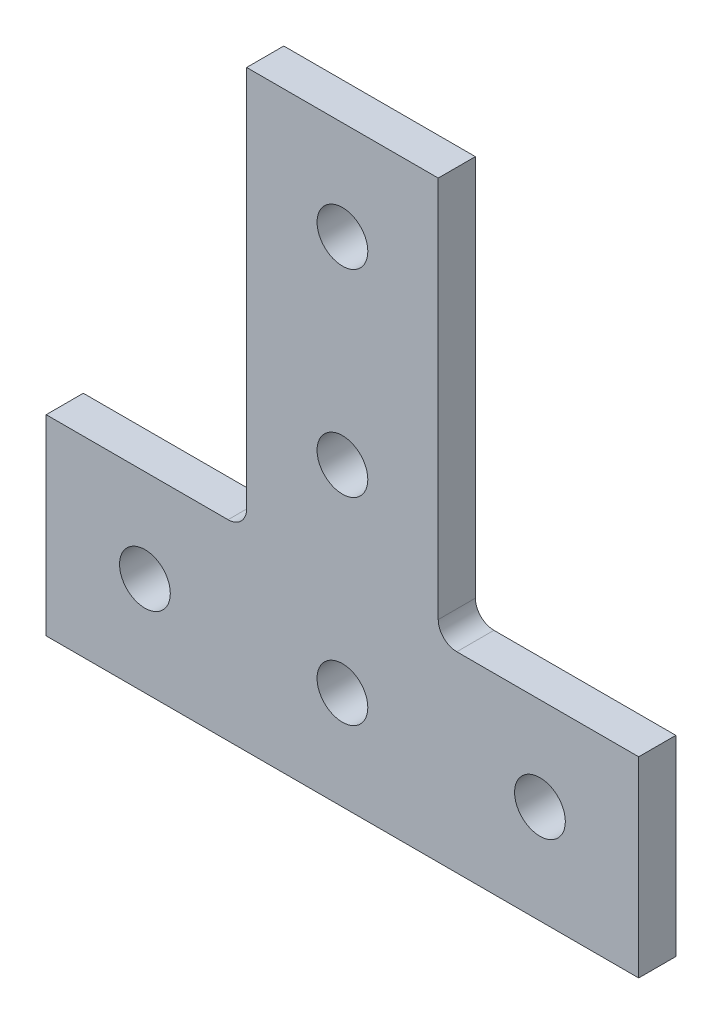
ISO-10303-21;
HEADER;
FILE_DESCRIPTION(('STEP AP214'),'2;1');
FILE_NAME('part.step','',(''),(''),'','','');
FILE_SCHEMA(('AUTOMOTIVE_DESIGN { 1 0 10303 214 1 1 1 1 }'));
ENDSEC;
DATA;
#1=APPLICATION_CONTEXT('core data for automotive mechanical design processes');
#2=APPLICATION_PROTOCOL_DEFINITION('international standard','automotive_design',2000,#1);
#3=PRODUCT_CONTEXT('',#1,'mechanical');
#4=PRODUCT('Part','Part','',(#3));
#5=PRODUCT_RELATED_PRODUCT_CATEGORY('part','',(#4));
#6=PRODUCT_DEFINITION_FORMATION('','',#4);
#7=PRODUCT_DEFINITION_CONTEXT('part definition',#1,'design');
#8=PRODUCT_DEFINITION('design','',#6,#7);
#9=PRODUCT_DEFINITION_SHAPE('','',#8);
#10=(LENGTH_UNIT() NAMED_UNIT(*) SI_UNIT(.MILLI.,.METRE.));
#11=(NAMED_UNIT(*) PLANE_ANGLE_UNIT() SI_UNIT($,.RADIAN.));
#12=(NAMED_UNIT(*) SI_UNIT($,.STERADIAN.) SOLID_ANGLE_UNIT());
#13=UNCERTAINTY_MEASURE_WITH_UNIT(LENGTH_MEASURE(1.E-05),#10,'distance_accuracy_value','');
#14=(GEOMETRIC_REPRESENTATION_CONTEXT(3) GLOBAL_UNCERTAINTY_ASSIGNED_CONTEXT((#13)) GLOBAL_UNIT_ASSIGNED_CONTEXT((#10,
#11,#12)) REPRESENTATION_CONTEXT('',''));
#15=CARTESIAN_POINT('',(0.,0.,0.));
#16=DIRECTION('',(0.,0.,1.));
#17=DIRECTION('',(1.,0.,0.));
#18=AXIS2_PLACEMENT_3D('',#15,#16,#17);
#19=CARTESIAN_POINT('',(14.7066,27.0256,4.7752));
#20=DIRECTION('',(0.,0.,-1.));
#21=DIRECTION('',(-1.,0.,0.));
#22=AXIS2_PLACEMENT_3D('',#19,#20,#21);
#23=PLANE('',#22);
#24=CARTESIAN_POINT('',(0.,12.7,4.7752));
#25=DIRECTION('',(0.,0.,1.));
#26=DIRECTION('',(1.,0.,0.));
#27=AXIS2_PLACEMENT_3D('',#24,#25,#26);
#28=CIRCLE('',#27,3.2639);
#29=CARTESIAN_POINT('',(3.2639,12.7,4.7752));
#30=VERTEX_POINT('',#29);
#31=EDGE_CURVE('E224',#30,#30,#28,.T.);
#32=ORIENTED_EDGE('',*,*,#31,.F.);
#33=EDGE_LOOP('',(#32));
#34=FACE_BOUND('',#33,.T.);
#35=CARTESIAN_POINT('',(0.,38.1,4.7752));
#36=DIRECTION('',(0.,0.,1.));
#37=DIRECTION('',(1.,0.,0.));
#38=AXIS2_PLACEMENT_3D('',#35,#36,#37);
#39=CIRCLE('',#38,3.2639);
#40=CARTESIAN_POINT('',(3.2639,38.1,4.7752));
#41=VERTEX_POINT('',#40);
#42=EDGE_CURVE('E212',#41,#41,#39,.T.);
#43=ORIENTED_EDGE('',*,*,#42,.F.);
#44=EDGE_LOOP('',(#43));
#45=FACE_BOUND('',#44,.T.);
#46=DIRECTION('',(0.,-1.,0.));
#47=VECTOR('',#46,1.);
#48=CARTESIAN_POINT('',(-38.1,24.638,4.7752));
#49=LINE('',#48,#47);
#50=CARTESIAN_POINT('',(-38.1,24.638,4.7752));
#51=VERTEX_POINT('',#50);
#52=CARTESIAN_POINT('',(-38.1,0.,4.7752));
#53=VERTEX_POINT('',#52);
#54=EDGE_CURVE('E161',#51,#53,#49,.T.);
#55=ORIENTED_EDGE('',*,*,#54,.T.);
#56=DIRECTION('',(1.,0.,0.));
#57=VECTOR('',#56,1.);
#58=CARTESIAN_POINT('',(-38.1,0.,4.7752));
#59=LINE('',#58,#57);
#60=CARTESIAN_POINT('',(38.1,0.,4.7752));
#61=VERTEX_POINT('',#60);
#62=EDGE_CURVE('E99',#53,#61,#59,.T.);
#63=ORIENTED_EDGE('',*,*,#62,.T.);
#64=DIRECTION('',(0.,1.,0.));
#65=VECTOR('',#64,1.);
#66=CARTESIAN_POINT('',(38.1,0.,4.7752));
#67=LINE('',#66,#65);
#68=CARTESIAN_POINT('',(38.1,24.638,4.7752));
#69=VERTEX_POINT('',#68);
#70=EDGE_CURVE('E182',#61,#69,#67,.T.);
#71=ORIENTED_EDGE('',*,*,#70,.T.);
#72=DIRECTION('',(-1.,0.,0.));
#73=VECTOR('',#72,1.);
#74=CARTESIAN_POINT('',(38.1,24.638,4.7752));
#75=LINE('',#74,#73);
#76=CARTESIAN_POINT('',(14.7066,24.638,4.7752));
#77=VERTEX_POINT('',#76);
#78=EDGE_CURVE('E201',#69,#77,#75,.T.);
#79=ORIENTED_EDGE('',*,*,#78,.T.);
#80=CARTESIAN_POINT('',(14.7066,27.0256,4.7752));
#81=DIRECTION('',(0.,0.,-1.));
#82=DIRECTION('',(-1.,0.,0.));
#83=AXIS2_PLACEMENT_3D('',#80,#81,#82);
#84=CIRCLE('',#83,2.38760000000001);
#85=CARTESIAN_POINT('',(12.319,27.0256,4.7752));
#86=VERTEX_POINT('',#85);
#87=EDGE_CURVE('E198',#77,#86,#84,.T.);
#88=ORIENTED_EDGE('',*,*,#87,.T.);
#89=DIRECTION('',(0.,1.,0.));
#90=VECTOR('',#89,1.);
#91=CARTESIAN_POINT('',(12.319,27.0256,4.7752));
#92=LINE('',#91,#90);
#93=CARTESIAN_POINT('',(12.319,76.2,4.7752));
#94=VERTEX_POINT('',#93);
#95=EDGE_CURVE('E200',#86,#94,#92,.T.);
#96=ORIENTED_EDGE('',*,*,#95,.T.);
#97=DIRECTION('',(-1.,0.,0.));
#98=VECTOR('',#97,1.);
#99=CARTESIAN_POINT('',(12.319,76.2,4.7752));
#100=LINE('',#99,#98);
#101=CARTESIAN_POINT('',(-12.319,76.2,4.7752));
#102=VERTEX_POINT('',#101);
#103=EDGE_CURVE('E124',#94,#102,#100,.T.);
#104=ORIENTED_EDGE('',*,*,#103,.T.);
#105=DIRECTION('',(0.,-1.,0.));
#106=VECTOR('',#105,1.);
#107=CARTESIAN_POINT('',(-12.319,76.2,4.7752));
#108=LINE('',#107,#106);
#109=CARTESIAN_POINT('',(-12.319,27.0256,4.7752));
#110=VERTEX_POINT('',#109);
#111=EDGE_CURVE('E118',#102,#110,#108,.T.);
#112=ORIENTED_EDGE('',*,*,#111,.T.);
#113=CARTESIAN_POINT('',(-14.7066,27.0256,4.7752));
#114=DIRECTION('',(0.,0.,-1.));
#115=DIRECTION('',(-1.,0.,0.));
#116=AXIS2_PLACEMENT_3D('',#113,#114,#115);
#117=CIRCLE('',#116,2.3876);
#118=CARTESIAN_POINT('',(-14.7066,24.638,4.7752));
#119=VERTEX_POINT('',#118);
#120=EDGE_CURVE('E122',#110,#119,#117,.T.);
#121=ORIENTED_EDGE('',*,*,#120,.T.);
#122=DIRECTION('',(-1.,0.,0.));
#123=VECTOR('',#122,1.);
#124=CARTESIAN_POINT('',(-14.7066,24.638,4.7752));
#125=LINE('',#124,#123);
#126=EDGE_CURVE('E50',#119,#51,#125,.T.);
#127=ORIENTED_EDGE('',*,*,#126,.T.);
#128=EDGE_LOOP('',(#55,#63,#71,#79,#88,#96,#104,#112,#121,#127));
#129=FACE_BOUND('',#128,.T.);
#130=CARTESIAN_POINT('',(25.4,12.7,4.7752));
#131=DIRECTION('',(0.,0.,1.));
#132=DIRECTION('',(1.,0.,0.));
#133=AXIS2_PLACEMENT_3D('',#130,#131,#132);
#134=CIRCLE('',#133,3.2639);
#135=CARTESIAN_POINT('',(28.6639,12.7,4.7752));
#136=VERTEX_POINT('',#135);
#137=EDGE_CURVE('E146',#136,#136,#134,.T.);
#138=ORIENTED_EDGE('',*,*,#137,.F.);
#139=EDGE_LOOP('',(#138));
#140=FACE_BOUND('',#139,.T.);
#141=CARTESIAN_POINT('',(0.,63.5,4.7752));
#142=DIRECTION('',(0.,0.,1.));
#143=DIRECTION('',(1.,0.,0.));
#144=AXIS2_PLACEMENT_3D('',#141,#142,#143);
#145=CIRCLE('',#144,3.2639);
#146=CARTESIAN_POINT('',(3.2639,63.5,4.7752));
#147=VERTEX_POINT('',#146);
#148=EDGE_CURVE('E218',#147,#147,#145,.T.);
#149=ORIENTED_EDGE('',*,*,#148,.F.);
#150=EDGE_LOOP('',(#149));
#151=FACE_BOUND('',#150,.T.);
#152=CARTESIAN_POINT('',(-25.4,12.7,4.7752));
#153=DIRECTION('',(0.,0.,1.));
#154=DIRECTION('',(1.,0.,0.));
#155=AXIS2_PLACEMENT_3D('',#152,#153,#154);
#156=CIRCLE('',#155,3.2639);
#157=CARTESIAN_POINT('',(-22.1361,12.7,4.7752));
#158=VERTEX_POINT('',#157);
#159=EDGE_CURVE('E230',#158,#158,#156,.T.);
#160=ORIENTED_EDGE('',*,*,#159,.F.);
#161=EDGE_LOOP('',(#160));
#162=FACE_BOUND('',#161,.T.);
#163=ADVANCED_FACE('F33',(#34,#45,#129,#140,#151,#162),#23,.F.);
#164=CARTESIAN_POINT('',(14.7066,27.0256,0.));
#165=DIRECTION('',(0.,0.,-1.));
#166=DIRECTION('',(-1.,0.,0.));
#167=AXIS2_PLACEMENT_3D('',#164,#165,#166);
#168=PLANE('',#167);
#169=CARTESIAN_POINT('',(0.,12.7,0.));
#170=DIRECTION('',(0.,0.,1.));
#171=DIRECTION('',(1.,0.,0.));
#172=AXIS2_PLACEMENT_3D('',#169,#170,#171);
#173=CIRCLE('',#172,3.2639);
#174=CARTESIAN_POINT('',(3.2639,12.7,0.));
#175=VERTEX_POINT('',#174);
#176=EDGE_CURVE('E227',#175,#175,#173,.T.);
#177=ORIENTED_EDGE('',*,*,#176,.T.);
#178=EDGE_LOOP('',(#177));
#179=FACE_BOUND('',#178,.T.);
#180=CARTESIAN_POINT('',(0.,38.1,0.));
#181=DIRECTION('',(0.,0.,1.));
#182=DIRECTION('',(1.,0.,0.));
#183=AXIS2_PLACEMENT_3D('',#180,#181,#182);
#184=CIRCLE('',#183,3.2639);
#185=CARTESIAN_POINT('',(3.2639,38.1,0.));
#186=VERTEX_POINT('',#185);
#187=EDGE_CURVE('E215',#186,#186,#184,.T.);
#188=ORIENTED_EDGE('',*,*,#187,.T.);
#189=EDGE_LOOP('',(#188));
#190=FACE_BOUND('',#189,.T.);
#191=DIRECTION('',(0.,-1.,0.));
#192=VECTOR('',#191,1.);
#193=CARTESIAN_POINT('',(-38.1,24.638,0.));
#194=LINE('',#193,#192);
#195=CARTESIAN_POINT('',(-38.1,24.638,0.));
#196=VERTEX_POINT('',#195);
#197=CARTESIAN_POINT('',(-38.1,0.,0.));
#198=VERTEX_POINT('',#197);
#199=EDGE_CURVE('E142',#196,#198,#194,.T.);
#200=ORIENTED_EDGE('',*,*,#199,.F.);
#201=DIRECTION('',(-1.,0.,0.));
#202=VECTOR('',#201,1.);
#203=CARTESIAN_POINT('',(-14.7066,24.638,0.));
#204=LINE('',#203,#202);
#205=CARTESIAN_POINT('',(-14.7066,24.638,0.));
#206=VERTEX_POINT('',#205);
#207=EDGE_CURVE('E91',#206,#196,#204,.T.);
#208=ORIENTED_EDGE('',*,*,#207,.F.);
#209=CARTESIAN_POINT('',(-14.7066,27.0256,0.));
#210=DIRECTION('',(0.,0.,-1.));
#211=DIRECTION('',(-1.,0.,0.));
#212=AXIS2_PLACEMENT_3D('',#209,#210,#211);
#213=CIRCLE('',#212,2.3876);
#214=CARTESIAN_POINT('',(-12.319,27.0256,0.));
#215=VERTEX_POINT('',#214);
#216=EDGE_CURVE('E85',#215,#206,#213,.T.);
#217=ORIENTED_EDGE('',*,*,#216,.F.);
#218=DIRECTION('',(0.,-1.,0.));
#219=VECTOR('',#218,1.);
#220=CARTESIAN_POINT('',(-12.319,76.2,0.));
#221=LINE('',#220,#219);
#222=CARTESIAN_POINT('',(-12.319,76.2,0.));
#223=VERTEX_POINT('',#222);
#224=EDGE_CURVE('E132',#223,#215,#221,.T.);
#225=ORIENTED_EDGE('',*,*,#224,.F.);
#226=DIRECTION('',(-1.,0.,0.));
#227=VECTOR('',#226,1.);
#228=CARTESIAN_POINT('',(12.319,76.2,0.));
#229=LINE('',#228,#227);
#230=CARTESIAN_POINT('',(12.319,76.2,0.));
#231=VERTEX_POINT('',#230);
#232=EDGE_CURVE('E156',#231,#223,#229,.T.);
#233=ORIENTED_EDGE('',*,*,#232,.F.);
#234=DIRECTION('',(0.,1.,0.));
#235=VECTOR('',#234,1.);
#236=CARTESIAN_POINT('',(12.319,27.0256,0.));
#237=LINE('',#236,#235);
#238=CARTESIAN_POINT('',(12.319,27.0256,0.));
#239=VERTEX_POINT('',#238);
#240=EDGE_CURVE('E154',#239,#231,#237,.T.);
#241=ORIENTED_EDGE('',*,*,#240,.F.);
#242=CARTESIAN_POINT('',(14.7066,27.0256,0.));
#243=DIRECTION('',(0.,0.,-1.));
#244=DIRECTION('',(-1.,0.,0.));
#245=AXIS2_PLACEMENT_3D('',#242,#243,#244);
#246=CIRCLE('',#245,2.38760000000001);
#247=CARTESIAN_POINT('',(14.7066,24.638,0.));
#248=VERTEX_POINT('',#247);
#249=EDGE_CURVE('E152',#248,#239,#246,.T.);
#250=ORIENTED_EDGE('',*,*,#249,.F.);
#251=DIRECTION('',(-1.,0.,0.));
#252=VECTOR('',#251,1.);
#253=CARTESIAN_POINT('',(38.1,24.638,0.));
#254=LINE('',#253,#252);
#255=CARTESIAN_POINT('',(38.1,24.638,0.));
#256=VERTEX_POINT('',#255);
#257=EDGE_CURVE('E150',#256,#248,#254,.T.);
#258=ORIENTED_EDGE('',*,*,#257,.F.);
#259=DIRECTION('',(0.,1.,0.));
#260=VECTOR('',#259,1.);
#261=CARTESIAN_POINT('',(38.1,0.,0.));
#262=LINE('',#261,#260);
#263=CARTESIAN_POINT('',(38.1,0.,0.));
#264=VERTEX_POINT('',#263);
#265=EDGE_CURVE('E148',#264,#256,#262,.T.);
#266=ORIENTED_EDGE('',*,*,#265,.F.);
#267=DIRECTION('',(1.,0.,0.));
#268=VECTOR('',#267,1.);
#269=CARTESIAN_POINT('',(-38.1,0.,0.));
#270=LINE('',#269,#268);
#271=EDGE_CURVE('E145',#198,#264,#270,.T.);
#272=ORIENTED_EDGE('',*,*,#271,.F.);
#273=EDGE_LOOP('',(#200,#208,#217,#225,#233,#241,#250,#258,#266,#272));
#274=FACE_BOUND('',#273,.T.);
#275=CARTESIAN_POINT('',(25.4,12.7,0.));
#276=DIRECTION('',(0.,0.,1.));
#277=DIRECTION('',(1.,0.,0.));
#278=AXIS2_PLACEMENT_3D('',#275,#276,#277);
#279=CIRCLE('',#278,3.2639);
#280=CARTESIAN_POINT('',(28.6639,12.7,0.));
#281=VERTEX_POINT('',#280);
#282=EDGE_CURVE('E209',#281,#281,#279,.T.);
#283=ORIENTED_EDGE('',*,*,#282,.T.);
#284=EDGE_LOOP('',(#283));
#285=FACE_BOUND('',#284,.T.);
#286=CARTESIAN_POINT('',(0.,63.5,0.));
#287=DIRECTION('',(0.,0.,1.));
#288=DIRECTION('',(1.,0.,0.));
#289=AXIS2_PLACEMENT_3D('',#286,#287,#288);
#290=CIRCLE('',#289,3.2639);
#291=CARTESIAN_POINT('',(3.2639,63.5,0.));
#292=VERTEX_POINT('',#291);
#293=EDGE_CURVE('E221',#292,#292,#290,.T.);
#294=ORIENTED_EDGE('',*,*,#293,.T.);
#295=EDGE_LOOP('',(#294));
#296=FACE_BOUND('',#295,.T.);
#297=CARTESIAN_POINT('',(-25.4,12.7,0.));
#298=DIRECTION('',(0.,0.,1.));
#299=DIRECTION('',(1.,0.,0.));
#300=AXIS2_PLACEMENT_3D('',#297,#298,#299);
#301=CIRCLE('',#300,3.2639);
#302=CARTESIAN_POINT('',(-22.1361,12.7,0.));
#303=VERTEX_POINT('',#302);
#304=EDGE_CURVE('E233',#303,#303,#301,.T.);
#305=ORIENTED_EDGE('',*,*,#304,.T.);
#306=EDGE_LOOP('',(#305));
#307=FACE_BOUND('',#306,.T.);
#308=ADVANCED_FACE('F186',(#179,#190,#274,#285,#296,#307),#168,.T.);
#309=CARTESIAN_POINT('',(-38.1,24.638,4.7752));
#310=DIRECTION('',(1.,0.,0.));
#311=DIRECTION('',(0.,0.,-1.));
#312=AXIS2_PLACEMENT_3D('',#309,#310,#311);
#313=PLANE('',#312);
#314=ORIENTED_EDGE('',*,*,#199,.T.);
#315=DIRECTION('',(0.,0.,-1.));
#316=VECTOR('',#315,1.);
#317=CARTESIAN_POINT('',(-38.1,0.,4.7752));
#318=LINE('',#317,#316);
#319=EDGE_CURVE('E11',#53,#198,#318,.T.);
#320=ORIENTED_EDGE('',*,*,#319,.F.);
#321=ORIENTED_EDGE('',*,*,#54,.F.);
#322=DIRECTION('',(0.,0.,-1.));
#323=VECTOR('',#322,1.);
#324=CARTESIAN_POINT('',(-38.1,24.638,4.7752));
#325=LINE('',#324,#323);
#326=EDGE_CURVE('E138',#51,#196,#325,.T.);
#327=ORIENTED_EDGE('',*,*,#326,.T.);
#328=EDGE_LOOP('',(#314,#320,#321,#327));
#329=FACE_BOUND('',#328,.T.);
#330=ADVANCED_FACE('F35',(#329),#313,.F.);
#331=CARTESIAN_POINT('',(-38.1,0.,4.7752));
#332=DIRECTION('',(0.,1.,0.));
#333=DIRECTION('',(0.,0.,1.));
#334=AXIS2_PLACEMENT_3D('',#331,#332,#333);
#335=PLANE('',#334);
#336=ORIENTED_EDGE('',*,*,#271,.T.);
#337=DIRECTION('',(0.,0.,-1.));
#338=VECTOR('',#337,1.);
#339=CARTESIAN_POINT('',(38.1,0.,4.7752));
#340=LINE('',#339,#338);
#341=EDGE_CURVE('E42',#61,#264,#340,.T.);
#342=ORIENTED_EDGE('',*,*,#341,.F.);
#343=ORIENTED_EDGE('',*,*,#62,.F.);
#344=ORIENTED_EDGE('',*,*,#319,.T.);
#345=EDGE_LOOP('',(#336,#342,#343,#344));
#346=FACE_BOUND('',#345,.T.);
#347=ADVANCED_FACE('F276',(#346),#335,.F.);
#348=CARTESIAN_POINT('',(38.1,0.,4.7752));
#349=DIRECTION('',(-1.,0.,0.));
#350=DIRECTION('',(0.,0.,1.));
#351=AXIS2_PLACEMENT_3D('',#348,#349,#350);
#352=PLANE('',#351);
#353=ORIENTED_EDGE('',*,*,#265,.T.);
#354=DIRECTION('',(0.,0.,-1.));
#355=VECTOR('',#354,1.);
#356=CARTESIAN_POINT('',(38.1,24.638,4.7752));
#357=LINE('',#356,#355);
#358=EDGE_CURVE('E174',#69,#256,#357,.T.);
#359=ORIENTED_EDGE('',*,*,#358,.F.);
#360=ORIENTED_EDGE('',*,*,#70,.F.);
#361=ORIENTED_EDGE('',*,*,#341,.T.);
#362=EDGE_LOOP('',(#353,#359,#360,#361));
#363=FACE_BOUND('',#362,.T.);
#364=ADVANCED_FACE('F180',(#363),#352,.F.);
#365=CARTESIAN_POINT('',(38.1,24.638,4.7752));
#366=DIRECTION('',(0.,-1.,0.));
#367=DIRECTION('',(0.,0.,-1.));
#368=AXIS2_PLACEMENT_3D('',#365,#366,#367);
#369=PLANE('',#368);
#370=ORIENTED_EDGE('',*,*,#257,.T.);
#371=DIRECTION('',(0.,0.,-1.));
#372=VECTOR('',#371,1.);
#373=CARTESIAN_POINT('',(14.7066,24.638,4.7752));
#374=LINE('',#373,#372);
#375=EDGE_CURVE('E171',#77,#248,#374,.T.);
#376=ORIENTED_EDGE('',*,*,#375,.F.);
#377=ORIENTED_EDGE('',*,*,#78,.F.);
#378=ORIENTED_EDGE('',*,*,#358,.T.);
#379=EDGE_LOOP('',(#370,#376,#377,#378));
#380=FACE_BOUND('',#379,.T.);
#381=ADVANCED_FACE('F192',(#380),#369,.F.);
#382=CARTESIAN_POINT('',(14.7066,27.0256,4.7752));
#383=DIRECTION('',(0.,0.,-1.));
#384=DIRECTION('',(-1.,0.,0.));
#385=AXIS2_PLACEMENT_3D('',#382,#383,#384);
#386=CYLINDRICAL_SURFACE('',#385,2.38760000000001);
#387=ORIENTED_EDGE('',*,*,#249,.T.);
#388=DIRECTION('',(0.,0.,-1.));
#389=VECTOR('',#388,1.);
#390=CARTESIAN_POINT('',(12.319,27.0256,4.7752));
#391=LINE('',#390,#389);
#392=EDGE_CURVE('E168',#86,#239,#391,.T.);
#393=ORIENTED_EDGE('',*,*,#392,.F.);
#394=ORIENTED_EDGE('',*,*,#87,.F.);
#395=ORIENTED_EDGE('',*,*,#375,.T.);
#396=EDGE_LOOP('',(#387,#393,#394,#395));
#397=FACE_BOUND('',#396,.T.);
#398=ADVANCED_FACE('F196',(#397),#386,.F.);
#399=CARTESIAN_POINT('',(12.319,27.0256,4.7752));
#400=DIRECTION('',(-1.,0.,0.));
#401=DIRECTION('',(0.,0.,1.));
#402=AXIS2_PLACEMENT_3D('',#399,#400,#401);
#403=PLANE('',#402);
#404=ORIENTED_EDGE('',*,*,#240,.T.);
#405=DIRECTION('',(0.,0.,-1.));
#406=VECTOR('',#405,1.);
#407=CARTESIAN_POINT('',(12.319,76.2,4.7752));
#408=LINE('',#407,#406);
#409=EDGE_CURVE('E165',#94,#231,#408,.T.);
#410=ORIENTED_EDGE('',*,*,#409,.F.);
#411=ORIENTED_EDGE('',*,*,#95,.F.);
#412=ORIENTED_EDGE('',*,*,#392,.T.);
#413=EDGE_LOOP('',(#404,#410,#411,#412));
#414=FACE_BOUND('',#413,.T.);
#415=ADVANCED_FACE('F266',(#414),#403,.F.);
#416=CARTESIAN_POINT('',(12.319,76.2,4.7752));
#417=DIRECTION('',(0.,-1.,0.));
#418=DIRECTION('',(0.,0.,-1.));
#419=AXIS2_PLACEMENT_3D('',#416,#417,#418);
#420=PLANE('',#419);
#421=ORIENTED_EDGE('',*,*,#232,.T.);
#422=DIRECTION('',(0.,0.,-1.));
#423=VECTOR('',#422,1.);
#424=CARTESIAN_POINT('',(-12.319,76.2,4.7752));
#425=LINE('',#424,#423);
#426=EDGE_CURVE('E133',#102,#223,#425,.T.);
#427=ORIENTED_EDGE('',*,*,#426,.F.);
#428=ORIENTED_EDGE('',*,*,#103,.F.);
#429=ORIENTED_EDGE('',*,*,#409,.T.);
#430=EDGE_LOOP('',(#421,#427,#428,#429));
#431=FACE_BOUND('',#430,.T.);
#432=ADVANCED_FACE('F263',(#431),#420,.F.);
#433=CARTESIAN_POINT('',(-12.319,76.2,4.7752));
#434=DIRECTION('',(1.,0.,0.));
#435=DIRECTION('',(0.,0.,-1.));
#436=AXIS2_PLACEMENT_3D('',#433,#434,#435);
#437=PLANE('',#436);
#438=ORIENTED_EDGE('',*,*,#224,.T.);
#439=DIRECTION('',(0.,0.,-1.));
#440=VECTOR('',#439,1.);
#441=CARTESIAN_POINT('',(-12.319,27.0256,4.7752));
#442=LINE('',#441,#440);
#443=EDGE_CURVE('E129',#110,#215,#442,.T.);
#444=ORIENTED_EDGE('',*,*,#443,.F.);
#445=ORIENTED_EDGE('',*,*,#111,.F.);
#446=ORIENTED_EDGE('',*,*,#426,.T.);
#447=EDGE_LOOP('',(#438,#444,#445,#446));
#448=FACE_BOUND('',#447,.T.);
#449=ADVANCED_FACE('F130',(#448),#437,.F.);
#450=CARTESIAN_POINT('',(-14.7066,27.0256,4.7752));
#451=DIRECTION('',(0.,0.,-1.));
#452=DIRECTION('',(-1.,0.,0.));
#453=AXIS2_PLACEMENT_3D('',#450,#451,#452);
#454=CYLINDRICAL_SURFACE('',#453,2.3876);
#455=ORIENTED_EDGE('',*,*,#216,.T.);
#456=DIRECTION('',(0.,0.,-1.));
#457=VECTOR('',#456,1.);
#458=CARTESIAN_POINT('',(-14.7066,24.638,4.7752));
#459=LINE('',#458,#457);
#460=EDGE_CURVE('E134',#119,#206,#459,.T.);
#461=ORIENTED_EDGE('',*,*,#460,.F.);
#462=ORIENTED_EDGE('',*,*,#120,.F.);
#463=ORIENTED_EDGE('',*,*,#443,.T.);
#464=EDGE_LOOP('',(#455,#461,#462,#463));
#465=FACE_BOUND('',#464,.T.);
#466=ADVANCED_FACE('F136',(#465),#454,.F.);
#467=CARTESIAN_POINT('',(-14.7066,24.638,4.7752));
#468=DIRECTION('',(0.,-1.,0.));
#469=DIRECTION('',(0.,0.,-1.));
#470=AXIS2_PLACEMENT_3D('',#467,#468,#469);
#471=PLANE('',#470);
#472=ORIENTED_EDGE('',*,*,#207,.T.);
#473=ORIENTED_EDGE('',*,*,#326,.F.);
#474=ORIENTED_EDGE('',*,*,#126,.F.);
#475=ORIENTED_EDGE('',*,*,#460,.T.);
#476=EDGE_LOOP('',(#472,#473,#474,#475));
#477=FACE_BOUND('',#476,.T.);
#478=ADVANCED_FACE('F256',(#477),#471,.F.);
#479=CARTESIAN_POINT('',(25.4,12.7,4.7752));
#480=DIRECTION('',(0.,0.,-1.));
#481=DIRECTION('',(-1.,0.,0.));
#482=AXIS2_PLACEMENT_3D('',#479,#480,#481);
#483=CYLINDRICAL_SURFACE('',#482,3.2639);
#484=ORIENTED_EDGE('',*,*,#137,.T.);
#485=EDGE_LOOP('',(#484));
#486=FACE_BOUND('',#485,.T.);
#487=ORIENTED_EDGE('',*,*,#282,.F.);
#488=EDGE_LOOP('',(#487));
#489=FACE_BOUND('',#488,.T.);
#490=ADVANCED_FACE('F253',(#486,#489),#483,.F.);
#491=CARTESIAN_POINT('',(0.,38.1,4.7752));
#492=DIRECTION('',(0.,0.,-1.));
#493=DIRECTION('',(-1.,0.,0.));
#494=AXIS2_PLACEMENT_3D('',#491,#492,#493);
#495=CYLINDRICAL_SURFACE('',#494,3.2639);
#496=ORIENTED_EDGE('',*,*,#42,.T.);
#497=EDGE_LOOP('',(#496));
#498=FACE_BOUND('',#497,.T.);
#499=ORIENTED_EDGE('',*,*,#187,.F.);
#500=EDGE_LOOP('',(#499));
#501=FACE_BOUND('',#500,.T.);
#502=ADVANCED_FACE('F352',(#498,#501),#495,.F.);
#503=CARTESIAN_POINT('',(0.,63.5,4.7752));
#504=DIRECTION('',(0.,0.,-1.));
#505=DIRECTION('',(-1.,0.,0.));
#506=AXIS2_PLACEMENT_3D('',#503,#504,#505);
#507=CYLINDRICAL_SURFACE('',#506,3.2639);
#508=ORIENTED_EDGE('',*,*,#148,.T.);
#509=EDGE_LOOP('',(#508));
#510=FACE_BOUND('',#509,.T.);
#511=ORIENTED_EDGE('',*,*,#293,.F.);
#512=EDGE_LOOP('',(#511));
#513=FACE_BOUND('',#512,.T.);
#514=ADVANCED_FACE('F360',(#510,#513),#507,.F.);
#515=CARTESIAN_POINT('',(0.,12.7,4.7752));
#516=DIRECTION('',(0.,0.,-1.));
#517=DIRECTION('',(-1.,0.,0.));
#518=AXIS2_PLACEMENT_3D('',#515,#516,#517);
#519=CYLINDRICAL_SURFACE('',#518,3.2639);
#520=ORIENTED_EDGE('',*,*,#31,.T.);
#521=EDGE_LOOP('',(#520));
#522=FACE_BOUND('',#521,.T.);
#523=ORIENTED_EDGE('',*,*,#176,.F.);
#524=EDGE_LOOP('',(#523));
#525=FACE_BOUND('',#524,.T.);
#526=ADVANCED_FACE('F368',(#522,#525),#519,.F.);
#527=CARTESIAN_POINT('',(-25.4,12.7,4.7752));
#528=DIRECTION('',(0.,0.,-1.));
#529=DIRECTION('',(-1.,0.,0.));
#530=AXIS2_PLACEMENT_3D('',#527,#528,#529);
#531=CYLINDRICAL_SURFACE('',#530,3.2639);
#532=ORIENTED_EDGE('',*,*,#159,.T.);
#533=EDGE_LOOP('',(#532));
#534=FACE_BOUND('',#533,.T.);
#535=ORIENTED_EDGE('',*,*,#304,.F.);
#536=EDGE_LOOP('',(#535));
#537=FACE_BOUND('',#536,.T.);
#538=ADVANCED_FACE('F239',(#534,#537),#531,.F.);
#539=CLOSED_SHELL('',(#163,#308,#330,#347,#364,#381,#398,#415,#432,#449,#466,#478,#490,#502,
#514,#526,#538));
#540=MANIFOLD_SOLID_BREP('B2',#539);
#541=ADVANCED_BREP_SHAPE_REPRESENTATION('',(#18,#540),#14);
#542=SHAPE_DEFINITION_REPRESENTATION(#9,#541);
ENDSEC;
END-ISO-10303-21;
